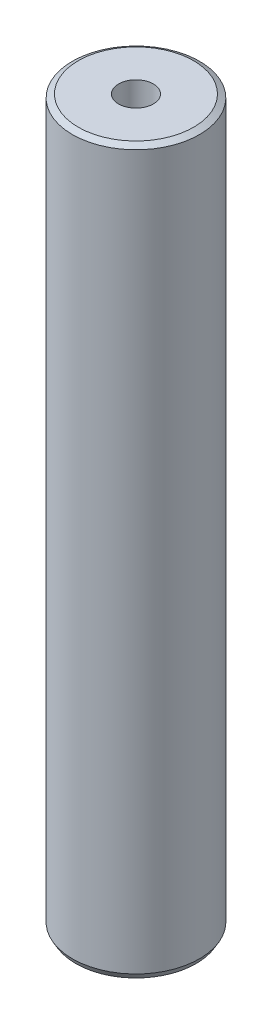
ISO-10303-21;
HEADER;
FILE_DESCRIPTION(('STEP AP214'),'2;1');
FILE_NAME('part.step','',(''),(''),'','','');
FILE_SCHEMA(('AUTOMOTIVE_DESIGN { 1 0 10303 214 1 1 1 1 }'));
ENDSEC;
DATA;
#1=APPLICATION_CONTEXT('core data for automotive mechanical design processes');
#2=APPLICATION_PROTOCOL_DEFINITION('international standard','automotive_design',2000,#1);
#3=PRODUCT_CONTEXT('',#1,'mechanical');
#4=PRODUCT('Part','Part','',(#3));
#5=PRODUCT_RELATED_PRODUCT_CATEGORY('part','',(#4));
#6=PRODUCT_DEFINITION_FORMATION('','',#4);
#7=PRODUCT_DEFINITION_CONTEXT('part definition',#1,'design');
#8=PRODUCT_DEFINITION('design','',#6,#7);
#9=PRODUCT_DEFINITION_SHAPE('','',#8);
#10=(LENGTH_UNIT() NAMED_UNIT(*) SI_UNIT(.MILLI.,.METRE.));
#11=(NAMED_UNIT(*) PLANE_ANGLE_UNIT() SI_UNIT($,.RADIAN.));
#12=(NAMED_UNIT(*) SI_UNIT($,.STERADIAN.) SOLID_ANGLE_UNIT());
#13=UNCERTAINTY_MEASURE_WITH_UNIT(LENGTH_MEASURE(1.E-05),#10,'distance_accuracy_value','');
#14=(GEOMETRIC_REPRESENTATION_CONTEXT(3) GLOBAL_UNCERTAINTY_ASSIGNED_CONTEXT((#13)) GLOBAL_UNIT_ASSIGNED_CONTEXT((#10,
#11,#12)) REPRESENTATION_CONTEXT('',''));
#15=CARTESIAN_POINT('',(0.,0.,0.));
#16=DIRECTION('',(0.,0.,1.));
#17=DIRECTION('',(1.,0.,0.));
#18=AXIS2_PLACEMENT_3D('',#15,#16,#17);
#19=CARTESIAN_POINT('',(0.,142.198984400388,0.));
#20=DIRECTION('',(0.,-1.,0.));
#21=DIRECTION('',(0.,0.,-1.));
#22=AXIS2_PLACEMENT_3D('',#19,#20,#21);
#23=CYLINDRICAL_SURFACE('',#22,12.5);
#24=CARTESIAN_POINT('',(0.,141.528614615947,0.));
#25=DIRECTION('',(0.,1.,0.));
#26=DIRECTION('',(0.,0.,1.));
#27=AXIS2_PLACEMENT_3D('',#24,#25,#26);
#28=CIRCLE('',#27,12.5);
#29=CARTESIAN_POINT('',(0.,141.528614615947,12.5));
#30=VERTEX_POINT('',#29);
#31=EDGE_CURVE('E50',#30,#30,#28,.F.);
#32=ORIENTED_EDGE('',*,*,#31,.T.);
#33=EDGE_LOOP('',(#32));
#34=FACE_BOUND('',#33,.T.);
#35=CARTESIAN_POINT('',(0.,1.16111452651146,0.));
#36=DIRECTION('',(0.,1.,0.));
#37=DIRECTION('',(0.,0.,1.));
#38=AXIS2_PLACEMENT_3D('',#35,#36,#37);
#39=CIRCLE('',#38,12.5);
#40=CARTESIAN_POINT('',(0.,1.16111452651146,12.5));
#41=VERTEX_POINT('',#40);
#42=EDGE_CURVE('E51',#41,#41,#39,.T.);
#43=ORIENTED_EDGE('',*,*,#42,.T.);
#44=EDGE_LOOP('',(#43));
#45=FACE_BOUND('',#44,.T.);
#46=ADVANCED_FACE('F39',(#34,#45),#23,.T.);
#47=CARTESIAN_POINT('',(0.,142.198984400388,0.));
#48=DIRECTION('',(0.,1.,0.));
#49=DIRECTION('',(0.,0.,1.));
#50=AXIS2_PLACEMENT_3D('',#47,#48,#49);
#51=PLANE('',#50);
#52=CARTESIAN_POINT('',(0.,142.198984400388,0.));
#53=DIRECTION('',(0.,1.,0.));
#54=DIRECTION('',(0.,0.,1.));
#55=AXIS2_PLACEMENT_3D('',#52,#53,#54);
#56=CIRCLE('',#55,11.3388854734886);
#57=CARTESIAN_POINT('',(0.,142.198984400388,11.3388854734886));
#58=VERTEX_POINT('',#57);
#59=EDGE_CURVE('E54',#58,#58,#56,.T.);
#60=ORIENTED_EDGE('',*,*,#59,.T.);
#61=EDGE_LOOP('',(#60));
#62=FACE_BOUND('',#61,.T.);
#63=CARTESIAN_POINT('',(0.,142.198984400388,0.));
#64=DIRECTION('',(0.,1.,0.));
#65=DIRECTION('',(0.,0.,1.));
#66=AXIS2_PLACEMENT_3D('',#63,#64,#65);
#67=CIRCLE('',#66,3.41898681026971);
#68=CARTESIAN_POINT('',(0.,142.198984400388,3.41898681026971));
#69=VERTEX_POINT('',#68);
#70=EDGE_CURVE('E58',#69,#69,#67,.T.);
#71=ORIENTED_EDGE('',*,*,#70,.F.);
#72=EDGE_LOOP('',(#71));
#73=FACE_BOUND('',#72,.T.);
#74=ADVANCED_FACE('F69',(#62,#73),#51,.T.);
#75=CARTESIAN_POINT('',(0.,0.,0.));
#76=DIRECTION('',(0.,1.,0.));
#77=DIRECTION('',(0.,0.,1.));
#78=AXIS2_PLACEMENT_3D('',#75,#76,#77);
#79=PLANE('',#78);
#80=CARTESIAN_POINT('',(0.,0.,0.));
#81=DIRECTION('',(0.,1.,0.));
#82=DIRECTION('',(0.,0.,1.));
#83=AXIS2_PLACEMENT_3D('',#80,#81,#82);
#84=CIRCLE('',#83,11.8296302155586);
#85=CARTESIAN_POINT('',(0.,0.,11.8296302155586));
#86=VERTEX_POINT('',#85);
#87=EDGE_CURVE('E10',#86,#86,#84,.F.);
#88=ORIENTED_EDGE('',*,*,#87,.T.);
#89=EDGE_LOOP('',(#88));
#90=FACE_BOUND('',#89,.T.);
#91=CARTESIAN_POINT('',(0.,0.,0.));
#92=DIRECTION('',(0.,1.,0.));
#93=DIRECTION('',(0.,0.,1.));
#94=AXIS2_PLACEMENT_3D('',#91,#92,#93);
#95=CIRCLE('',#94,3.41898681026971);
#96=CARTESIAN_POINT('',(0.,0.,3.41898681026971));
#97=VERTEX_POINT('',#96);
#98=EDGE_CURVE('E63',#97,#97,#95,.T.);
#99=ORIENTED_EDGE('',*,*,#98,.T.);
#100=EDGE_LOOP('',(#99));
#101=FACE_BOUND('',#100,.T.);
#102=ADVANCED_FACE('F75',(#90,#101),#79,.F.);
#103=CARTESIAN_POINT('',(0.,142.198984400388,0.));
#104=DIRECTION('',(0.,-1.,0.));
#105=DIRECTION('',(0.,0.,-1.));
#106=AXIS2_PLACEMENT_3D('',#103,#104,#105);
#107=CYLINDRICAL_SURFACE('',#106,3.41898681026971);
#108=ORIENTED_EDGE('',*,*,#70,.T.);
#109=EDGE_LOOP('',(#108));
#110=FACE_BOUND('',#109,.T.);
#111=ORIENTED_EDGE('',*,*,#98,.F.);
#112=EDGE_LOOP('',(#111));
#113=FACE_BOUND('',#112,.T.);
#114=ADVANCED_FACE('F70',(#110,#113),#107,.F.);
#115=CARTESIAN_POINT('',(0.,142.198984400388,0.));
#116=DIRECTION('',(0.,-1.,0.));
#117=DIRECTION('',(0.,0.,-1.));
#118=AXIS2_PLACEMENT_3D('',#115,#116,#117);
#119=CONICAL_SURFACE('',#118,11.3388854734886,1.04719755119659);
#120=ORIENTED_EDGE('',*,*,#31,.F.);
#121=EDGE_LOOP('',(#120));
#122=FACE_BOUND('',#121,.T.);
#123=ORIENTED_EDGE('',*,*,#59,.F.);
#124=EDGE_LOOP('',(#123));
#125=FACE_BOUND('',#124,.T.);
#126=ADVANCED_FACE('F81',(#122,#125),#119,.T.);
#127=CARTESIAN_POINT('',(0.,1.16111452651146,0.));
#128=DIRECTION('',(0.,1.,0.));
#129=DIRECTION('',(0.,0.,1.));
#130=AXIS2_PLACEMENT_3D('',#127,#128,#129);
#131=CONICAL_SURFACE('',#130,12.5,0.523598775598295);
#132=ORIENTED_EDGE('',*,*,#87,.F.);
#133=EDGE_LOOP('',(#132));
#134=FACE_BOUND('',#133,.T.);
#135=ORIENTED_EDGE('',*,*,#42,.F.);
#136=EDGE_LOOP('',(#135));
#137=FACE_BOUND('',#136,.T.);
#138=ADVANCED_FACE('F45',(#134,#137),#131,.T.);
#139=CLOSED_SHELL('',(#46,#74,#102,#114,#126,#138));
#140=MANIFOLD_SOLID_BREP('B2',#139);
#141=ADVANCED_BREP_SHAPE_REPRESENTATION('',(#18,#140),#14);
#142=SHAPE_DEFINITION_REPRESENTATION(#9,#141);
ENDSEC;
END-ISO-10303-21;
